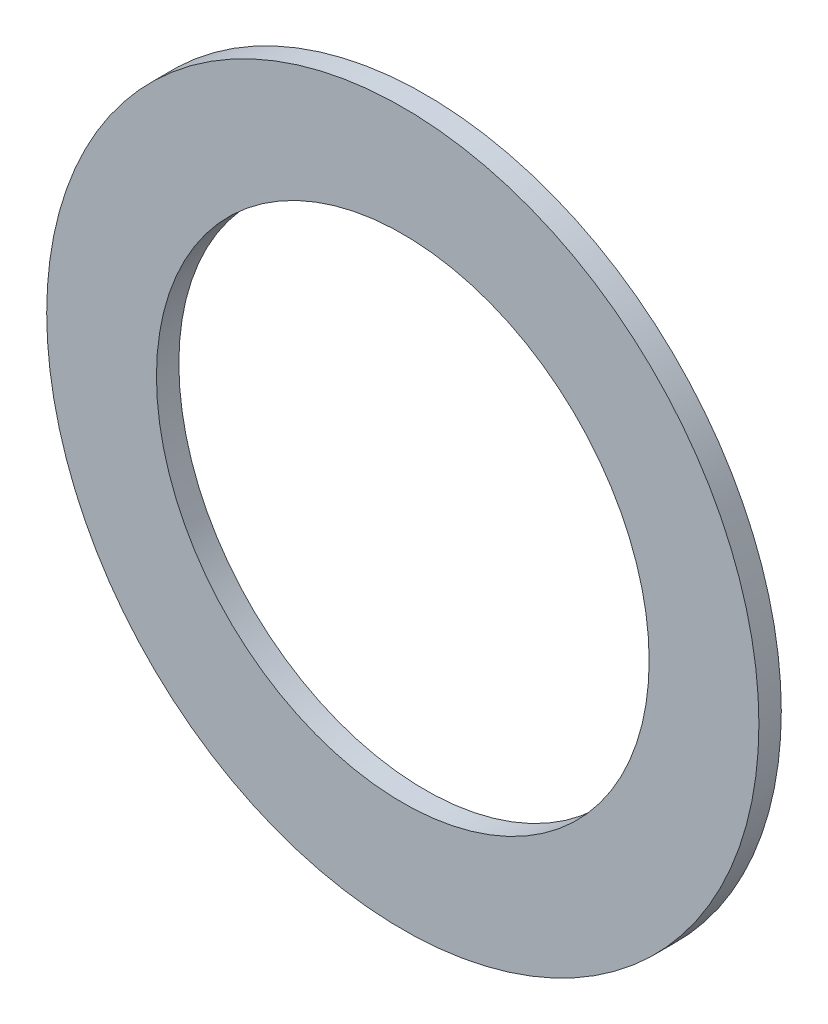
ISO-10303-21;
HEADER;
FILE_DESCRIPTION(('STEP AP214'),'2;1');
FILE_NAME('part.step','',(''),(''),'','','');
FILE_SCHEMA(('AUTOMOTIVE_DESIGN { 1 0 10303 214 1 1 1 1 }'));
ENDSEC;
DATA;
#1=APPLICATION_CONTEXT('core data for automotive mechanical design processes');
#2=APPLICATION_PROTOCOL_DEFINITION('international standard','automotive_design',2000,#1);
#3=PRODUCT_CONTEXT('',#1,'mechanical');
#4=PRODUCT('Part','Part','',(#3));
#5=PRODUCT_RELATED_PRODUCT_CATEGORY('part','',(#4));
#6=PRODUCT_DEFINITION_FORMATION('','',#4);
#7=PRODUCT_DEFINITION_CONTEXT('part definition',#1,'design');
#8=PRODUCT_DEFINITION('design','',#6,#7);
#9=PRODUCT_DEFINITION_SHAPE('','',#8);
#10=(LENGTH_UNIT() NAMED_UNIT(*) SI_UNIT(.MILLI.,.METRE.));
#11=(NAMED_UNIT(*) PLANE_ANGLE_UNIT() SI_UNIT($,.RADIAN.));
#12=(NAMED_UNIT(*) SI_UNIT($,.STERADIAN.) SOLID_ANGLE_UNIT());
#13=UNCERTAINTY_MEASURE_WITH_UNIT(LENGTH_MEASURE(1.E-05),#10,'distance_accuracy_value','');
#14=(GEOMETRIC_REPRESENTATION_CONTEXT(3) GLOBAL_UNCERTAINTY_ASSIGNED_CONTEXT((#13)) GLOBAL_UNIT_ASSIGNED_CONTEXT((#10,
#11,#12)) REPRESENTATION_CONTEXT('',''));
#15=CARTESIAN_POINT('',(0.,0.,0.));
#16=DIRECTION('',(0.,0.,1.));
#17=DIRECTION('',(1.,0.,0.));
#18=AXIS2_PLACEMENT_3D('',#15,#16,#17);
#19=CARTESIAN_POINT('',(0.,0.,0.5));
#20=DIRECTION('',(0.,0.,-1.));
#21=DIRECTION('',(-1.,0.,0.));
#22=AXIS2_PLACEMENT_3D('',#19,#20,#21);
#23=CYLINDRICAL_SURFACE('',#22,5.5);
#24=CARTESIAN_POINT('',(0.,0.,0.));
#25=DIRECTION('',(0.,0.,-1.));
#26=DIRECTION('',(1.,0.,0.));
#27=AXIS2_PLACEMENT_3D('',#24,#25,#26);
#28=CIRCLE('',#27,5.500000000612);
#29=CARTESIAN_POINT('',(5.500000000612,0.,0.));
#30=VERTEX_POINT('',#29);
#31=EDGE_CURVE('E10',#30,#30,#28,.T.);
#32=ORIENTED_EDGE('',*,*,#31,.T.);
#33=EDGE_LOOP('',(#32));
#34=FACE_BOUND('',#33,.T.);
#35=CARTESIAN_POINT('',(0.,0.,0.5));
#36=DIRECTION('',(0.,0.,1.));
#37=DIRECTION('',(1.,0.,0.));
#38=AXIS2_PLACEMENT_3D('',#35,#36,#37);
#39=CIRCLE('',#38,5.500000000612);
#40=CARTESIAN_POINT('',(5.500000000612,0.,0.5));
#41=VERTEX_POINT('',#40);
#42=EDGE_CURVE('E31',#41,#41,#39,.T.);
#43=ORIENTED_EDGE('',*,*,#42,.T.);
#44=EDGE_LOOP('',(#43));
#45=FACE_BOUND('',#44,.T.);
#46=ADVANCED_FACE('F15',(#34,#45),#23,.F.);
#47=CARTESIAN_POINT('',(-8.0454,-8.0454,0.));
#48=DIRECTION('',(0.,0.,1.));
#49=DIRECTION('',(1.,0.,0.));
#50=AXIS2_PLACEMENT_3D('',#47,#48,#49);
#51=PLANE('',#50);
#52=ORIENTED_EDGE('',*,*,#31,.F.);
#53=EDGE_LOOP('',(#52));
#54=FACE_BOUND('',#53,.T.);
#55=CARTESIAN_POINT('',(0.,0.,0.));
#56=DIRECTION('',(0.,0.,-1.));
#57=DIRECTION('',(1.,0.,0.));
#58=AXIS2_PLACEMENT_3D('',#55,#56,#57);
#59=CIRCLE('',#58,7.949999996057);
#60=CARTESIAN_POINT('',(7.949999996057,0.,0.));
#61=VERTEX_POINT('',#60);
#62=EDGE_CURVE('E22',#61,#61,#59,.T.);
#63=ORIENTED_EDGE('',*,*,#62,.T.);
#64=EDGE_LOOP('',(#63));
#65=FACE_BOUND('',#64,.T.);
#66=ADVANCED_FACE('F51',(#54,#65),#51,.F.);
#67=CARTESIAN_POINT('',(0.,0.,0.5));
#68=DIRECTION('',(0.,0.,-1.));
#69=DIRECTION('',(-1.,0.,0.));
#70=AXIS2_PLACEMENT_3D('',#67,#68,#69);
#71=CYLINDRICAL_SURFACE('',#70,7.95);
#72=ORIENTED_EDGE('',*,*,#62,.F.);
#73=EDGE_LOOP('',(#72));
#74=FACE_BOUND('',#73,.T.);
#75=CARTESIAN_POINT('',(0.,0.,0.5));
#76=DIRECTION('',(0.,0.,1.));
#77=DIRECTION('',(1.,0.,0.));
#78=AXIS2_PLACEMENT_3D('',#75,#76,#77);
#79=CIRCLE('',#78,7.949999996057);
#80=CARTESIAN_POINT('',(7.949999996057,0.,0.5));
#81=VERTEX_POINT('',#80);
#82=EDGE_CURVE('E38',#81,#81,#79,.T.);
#83=ORIENTED_EDGE('',*,*,#82,.F.);
#84=EDGE_LOOP('',(#83));
#85=FACE_BOUND('',#84,.T.);
#86=ADVANCED_FACE('F49',(#74,#85),#71,.T.);
#87=CARTESIAN_POINT('',(-8.0454,-8.0454,0.5));
#88=DIRECTION('',(0.,0.,1.));
#89=DIRECTION('',(1.,0.,0.));
#90=AXIS2_PLACEMENT_3D('',#87,#88,#89);
#91=PLANE('',#90);
#92=ORIENTED_EDGE('',*,*,#42,.F.);
#93=EDGE_LOOP('',(#92));
#94=FACE_BOUND('',#93,.T.);
#95=ORIENTED_EDGE('',*,*,#82,.T.);
#96=EDGE_LOOP('',(#95));
#97=FACE_BOUND('',#96,.T.);
#98=ADVANCED_FACE('F47',(#94,#97),#91,.T.);
#99=CLOSED_SHELL('',(#46,#66,#86,#98));
#100=MANIFOLD_SOLID_BREP('B1',#99);
#101=ADVANCED_BREP_SHAPE_REPRESENTATION('',(#18,#100),#14);
#102=SHAPE_DEFINITION_REPRESENTATION(#9,#101);
ENDSEC;
END-ISO-10303-21;
